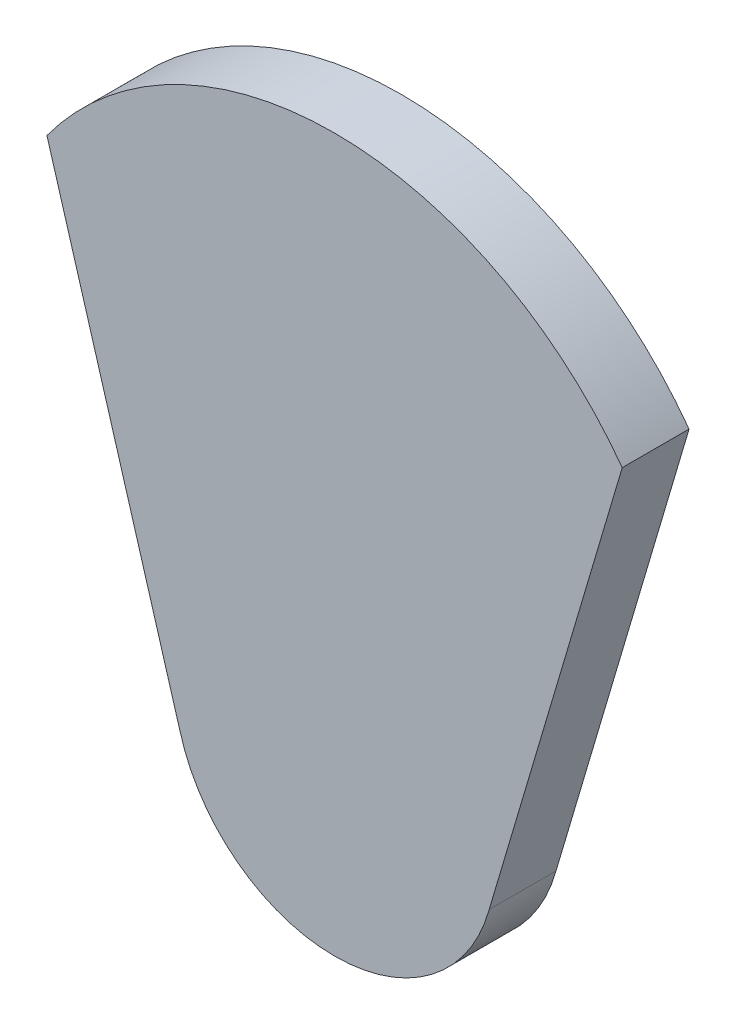
ISO-10303-21;
HEADER;
FILE_DESCRIPTION(('STEP AP214'),'2;1');
FILE_NAME('part.step','',(''),(''),'','','');
FILE_SCHEMA(('AUTOMOTIVE_DESIGN { 1 0 10303 214 1 1 1 1 }'));
ENDSEC;
DATA;
#1=APPLICATION_CONTEXT('core data for automotive mechanical design processes');
#2=APPLICATION_PROTOCOL_DEFINITION('international standard','automotive_design',2000,#1);
#3=PRODUCT_CONTEXT('',#1,'mechanical');
#4=PRODUCT('Part','Part','',(#3));
#5=PRODUCT_RELATED_PRODUCT_CATEGORY('part','',(#4));
#6=PRODUCT_DEFINITION_FORMATION('','',#4);
#7=PRODUCT_DEFINITION_CONTEXT('part definition',#1,'design');
#8=PRODUCT_DEFINITION('design','',#6,#7);
#9=PRODUCT_DEFINITION_SHAPE('','',#8);
#10=(LENGTH_UNIT() NAMED_UNIT(*) SI_UNIT(.MILLI.,.METRE.));
#11=(NAMED_UNIT(*) PLANE_ANGLE_UNIT() SI_UNIT($,.RADIAN.));
#12=(NAMED_UNIT(*) SI_UNIT($,.STERADIAN.) SOLID_ANGLE_UNIT());
#13=UNCERTAINTY_MEASURE_WITH_UNIT(LENGTH_MEASURE(1.E-05),#10,'distance_accuracy_value','');
#14=(GEOMETRIC_REPRESENTATION_CONTEXT(3) GLOBAL_UNCERTAINTY_ASSIGNED_CONTEXT((#13)) GLOBAL_UNIT_ASSIGNED_CONTEXT((#10,
#11,#12)) REPRESENTATION_CONTEXT('',''));
#15=CARTESIAN_POINT('',(0.,0.,0.));
#16=DIRECTION('',(0.,0.,1.));
#17=DIRECTION('',(1.,0.,0.));
#18=AXIS2_PLACEMENT_3D('',#15,#16,#17);
#19=CARTESIAN_POINT('',(1.36866526272708E-13,-1117.6,381.));
#20=DIRECTION('',(0.,0.,-1.));
#21=DIRECTION('',(-1.,0.,0.));
#22=AXIS2_PLACEMENT_3D('',#19,#20,#21);
#23=CYLINDRICAL_SURFACE('',#22,914.4);
#24=CARTESIAN_POINT('',(1.36866526272708E-13,-1117.6,0.));
#25=DIRECTION('',(0.,0.,1.));
#26=DIRECTION('',(1.,0.,0.));
#27=AXIS2_PLACEMENT_3D('',#24,#25,#26);
#28=CIRCLE('',#27,914.4);
#29=CARTESIAN_POINT('',(-881.273799142285,-1361.49311377184,0.));
#30=VERTEX_POINT('',#29);
#31=CARTESIAN_POINT('',(881.273799142285,-1361.49311377184,0.));
#32=VERTEX_POINT('',#31);
#33=EDGE_CURVE('E108',#30,#32,#28,.T.);
#34=ORIENTED_EDGE('',*,*,#33,.T.);
#35=DIRECTION('',(0.,0.,-1.));
#36=VECTOR('',#35,1.);
#37=CARTESIAN_POINT('',(881.273799142285,-1361.49311377184,381.));
#38=LINE('',#37,#36);
#39=CARTESIAN_POINT('',(881.273799142285,-1361.49311377184,381.));
#40=VERTEX_POINT('',#39);
#41=EDGE_CURVE('E11',#40,#32,#38,.T.);
#42=ORIENTED_EDGE('',*,*,#41,.F.);
#43=CARTESIAN_POINT('',(1.36866526272708E-13,-1117.6,381.));
#44=DIRECTION('',(0.,0.,1.));
#45=DIRECTION('',(1.,0.,0.));
#46=AXIS2_PLACEMENT_3D('',#43,#44,#45);
#47=CIRCLE('',#46,914.4);
#48=CARTESIAN_POINT('',(-881.273799142285,-1361.49311377184,381.));
#49=VERTEX_POINT('',#48);
#50=EDGE_CURVE('E81',#49,#40,#47,.T.);
#51=ORIENTED_EDGE('',*,*,#50,.F.);
#52=DIRECTION('',(0.,0.,-1.));
#53=VECTOR('',#52,1.);
#54=CARTESIAN_POINT('',(-881.273799142285,-1361.49311377184,381.));
#55=LINE('',#54,#53);
#56=EDGE_CURVE('E104',#49,#30,#55,.T.);
#57=ORIENTED_EDGE('',*,*,#56,.T.);
#58=EDGE_LOOP('',(#34,#42,#51,#57));
#59=FACE_BOUND('',#58,.T.);
#60=ADVANCED_FACE('F41',(#59),#23,.T.);
#61=CARTESIAN_POINT('',(1180.94724622433,-349.812511169955,381.));
#62=DIRECTION('',(0.958819734868193,-0.284015344703923,0.));
#63=DIRECTION('',(0.284015344703923,0.958819734868193,0.));
#64=AXIS2_PLACEMENT_3D('',#61,#62,#63);
#65=PLANE('',#64);
#66=DIRECTION('',(-0.284015344703923,-0.958819734868193,0.));
#67=VECTOR('',#66,1.);
#68=CARTESIAN_POINT('',(1180.94724622433,-349.812511169955,0.));
#69=LINE('',#68,#67);
#70=CARTESIAN_POINT('',(1639.96549799525,1199.8071367454,0.));
#71=VERTEX_POINT('',#70);
#72=EDGE_CURVE('E90',#71,#32,#69,.T.);
#73=ORIENTED_EDGE('',*,*,#72,.F.);
#74=DIRECTION('',(0.,0.,-1.));
#75=VECTOR('',#74,1.);
#76=CARTESIAN_POINT('',(1639.96549799525,1199.8071367454,381.));
#77=LINE('',#76,#75);
#78=CARTESIAN_POINT('',(1639.96549799525,1199.8071367454,381.));
#79=VERTEX_POINT('',#78);
#80=EDGE_CURVE('E50',#79,#71,#77,.T.);
#81=ORIENTED_EDGE('',*,*,#80,.F.);
#82=DIRECTION('',(-0.284015344703923,-0.958819734868193,0.));
#83=VECTOR('',#82,1.);
#84=CARTESIAN_POINT('',(1180.94724622433,-349.812511169955,381.));
#85=LINE('',#84,#83);
#86=EDGE_CURVE('E88',#79,#40,#85,.T.);
#87=ORIENTED_EDGE('',*,*,#86,.T.);
#88=ORIENTED_EDGE('',*,*,#41,.T.);
#89=EDGE_LOOP('',(#73,#81,#87,#88));
#90=FACE_BOUND('',#89,.T.);
#91=ADVANCED_FACE('F87',(#90),#65,.T.);
#92=CARTESIAN_POINT('',(0.,0.,381.));
#93=DIRECTION('',(0.,0.,-1.));
#94=DIRECTION('',(-1.,0.,0.));
#95=AXIS2_PLACEMENT_3D('',#92,#93,#94);
#96=CYLINDRICAL_SURFACE('',#95,2032.);
#97=CARTESIAN_POINT('',(0.,0.,0.));
#98=DIRECTION('',(0.,0.,1.));
#99=DIRECTION('',(1.,0.,0.));
#100=AXIS2_PLACEMENT_3D('',#97,#98,#99);
#101=CIRCLE('',#100,2032.);
#102=CARTESIAN_POINT('',(-1639.96549799525,1199.8071367454,0.));
#103=VERTEX_POINT('',#102);
#104=EDGE_CURVE('E114',#103,#71,#101,.F.);
#105=ORIENTED_EDGE('',*,*,#104,.F.);
#106=DIRECTION('',(0.,0.,-1.));
#107=VECTOR('',#106,1.);
#108=CARTESIAN_POINT('',(-1639.96549799525,1199.8071367454,381.));
#109=LINE('',#108,#107);
#110=CARTESIAN_POINT('',(-1639.96549799525,1199.8071367454,381.));
#111=VERTEX_POINT('',#110);
#112=EDGE_CURVE('E73',#111,#103,#109,.T.);
#113=ORIENTED_EDGE('',*,*,#112,.F.);
#114=CARTESIAN_POINT('',(0.,0.,381.));
#115=DIRECTION('',(0.,0.,1.));
#116=DIRECTION('',(1.,0.,0.));
#117=AXIS2_PLACEMENT_3D('',#114,#115,#116);
#118=CIRCLE('',#117,2032.);
#119=EDGE_CURVE('E97',#111,#79,#118,.F.);
#120=ORIENTED_EDGE('',*,*,#119,.T.);
#121=ORIENTED_EDGE('',*,*,#80,.T.);
#122=EDGE_LOOP('',(#105,#113,#120,#121));
#123=FACE_BOUND('',#122,.T.);
#124=ADVANCED_FACE('F100',(#123),#96,.T.);
#125=CARTESIAN_POINT('',(-1180.94724622433,-349.812511169955,381.));
#126=DIRECTION('',(0.958819734868193,0.284015344703923,0.));
#127=DIRECTION('',(-0.284015344703923,0.958819734868193,0.));
#128=AXIS2_PLACEMENT_3D('',#125,#126,#127);
#129=PLANE('',#128);
#130=DIRECTION('',(0.284015344703923,-0.958819734868193,0.));
#131=VECTOR('',#130,1.);
#132=CARTESIAN_POINT('',(-1180.94724622433,-349.812511169955,0.));
#133=LINE('',#132,#131);
#134=EDGE_CURVE('E76',#103,#30,#133,.T.);
#135=ORIENTED_EDGE('',*,*,#134,.T.);
#136=ORIENTED_EDGE('',*,*,#56,.F.);
#137=DIRECTION('',(0.284015344703923,-0.958819734868193,0.));
#138=VECTOR('',#137,1.);
#139=CARTESIAN_POINT('',(-1180.94724622433,-349.812511169955,381.));
#140=LINE('',#139,#138);
#141=EDGE_CURVE('E58',#111,#49,#140,.T.);
#142=ORIENTED_EDGE('',*,*,#141,.F.);
#143=ORIENTED_EDGE('',*,*,#112,.T.);
#144=EDGE_LOOP('',(#135,#136,#142,#143));
#145=FACE_BOUND('',#144,.T.);
#146=ADVANCED_FACE('F131',(#145),#129,.F.);
#147=CARTESIAN_POINT('',(0.,0.,381.));
#148=DIRECTION('',(0.,0.,1.));
#149=DIRECTION('',(1.,0.,0.));
#150=AXIS2_PLACEMENT_3D('',#147,#148,#149);
#151=PLANE('',#150);
#152=ORIENTED_EDGE('',*,*,#50,.T.);
#153=ORIENTED_EDGE('',*,*,#86,.F.);
#154=ORIENTED_EDGE('',*,*,#119,.F.);
#155=ORIENTED_EDGE('',*,*,#141,.T.);
#156=EDGE_LOOP('',(#152,#153,#154,#155));
#157=FACE_BOUND('',#156,.T.);
#158=ADVANCED_FACE('F96',(#157),#151,.T.);
#159=CARTESIAN_POINT('',(0.,0.,0.));
#160=DIRECTION('',(0.,0.,1.));
#161=DIRECTION('',(1.,0.,0.));
#162=AXIS2_PLACEMENT_3D('',#159,#160,#161);
#163=PLANE('',#162);
#164=ORIENTED_EDGE('',*,*,#33,.F.);
#165=ORIENTED_EDGE('',*,*,#134,.F.);
#166=ORIENTED_EDGE('',*,*,#104,.T.);
#167=ORIENTED_EDGE('',*,*,#72,.T.);
#168=EDGE_LOOP('',(#164,#165,#166,#167));
#169=FACE_BOUND('',#168,.T.);
#170=ADVANCED_FACE('F125',(#169),#163,.F.);
#171=CLOSED_SHELL('',(#60,#91,#124,#146,#158,#170));
#172=MANIFOLD_SOLID_BREP('B2',#171);
#173=ADVANCED_BREP_SHAPE_REPRESENTATION('',(#18,#172),#14);
#174=SHAPE_DEFINITION_REPRESENTATION(#9,#173);
ENDSEC;
END-ISO-10303-21;
